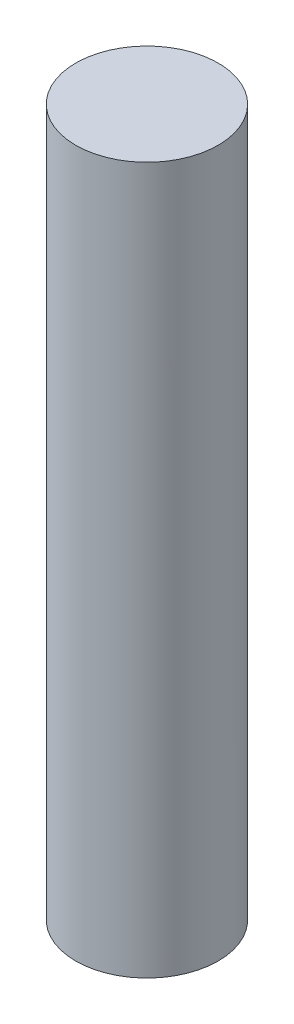
ISO-10303-21;
HEADER;
FILE_DESCRIPTION(('STEP AP214'),'2;1');
FILE_NAME('part.step','',(''),(''),'','','');
FILE_SCHEMA(('AUTOMOTIVE_DESIGN { 1 0 10303 214 1 1 1 1 }'));
ENDSEC;
DATA;
#1=APPLICATION_CONTEXT('core data for automotive mechanical design processes');
#2=APPLICATION_PROTOCOL_DEFINITION('international standard','automotive_design',2000,#1);
#3=PRODUCT_CONTEXT('',#1,'mechanical');
#4=PRODUCT('Part','Part','',(#3));
#5=PRODUCT_RELATED_PRODUCT_CATEGORY('part','',(#4));
#6=PRODUCT_DEFINITION_FORMATION('','',#4);
#7=PRODUCT_DEFINITION_CONTEXT('part definition',#1,'design');
#8=PRODUCT_DEFINITION('design','',#6,#7);
#9=PRODUCT_DEFINITION_SHAPE('','',#8);
#10=(LENGTH_UNIT() NAMED_UNIT(*) SI_UNIT(.MILLI.,.METRE.));
#11=(NAMED_UNIT(*) PLANE_ANGLE_UNIT() SI_UNIT($,.RADIAN.));
#12=(NAMED_UNIT(*) SI_UNIT($,.STERADIAN.) SOLID_ANGLE_UNIT());
#13=UNCERTAINTY_MEASURE_WITH_UNIT(LENGTH_MEASURE(1.E-05),#10,'distance_accuracy_value','');
#14=(GEOMETRIC_REPRESENTATION_CONTEXT(3) GLOBAL_UNCERTAINTY_ASSIGNED_CONTEXT((#13)) GLOBAL_UNIT_ASSIGNED_CONTEXT((#10,
#11,#12)) REPRESENTATION_CONTEXT('',''));
#15=CARTESIAN_POINT('',(0.,0.,0.));
#16=DIRECTION('',(0.,0.,1.));
#17=DIRECTION('',(1.,0.,0.));
#18=AXIS2_PLACEMENT_3D('',#15,#16,#17);
#19=CARTESIAN_POINT('',(3.126,-41.,3.12599999999999));
#20=DIRECTION('',(0.,-1.,0.));
#21=DIRECTION('',(-1.,0.,0.));
#22=AXIS2_PLACEMENT_3D('',#19,#20,#21);
#23=PLANE('',#22);
#24=CARTESIAN_POINT('',(0.,-41.,0.));
#25=DIRECTION('',(0.,-1.,0.));
#26=DIRECTION('',(0.,0.,-1.));
#27=AXIS2_PLACEMENT_3D('',#24,#25,#26);
#28=CIRCLE('',#27,3.125);
#29=CARTESIAN_POINT('',(0.,-41.,-3.12500000000001));
#30=VERTEX_POINT('',#29);
#31=EDGE_CURVE('E22',#30,#30,#28,.F.);
#32=ORIENTED_EDGE('',*,*,#31,.F.);
#33=EDGE_LOOP('',(#32));
#34=FACE_BOUND('',#33,.T.);
#35=ADVANCED_FACE('F15',(#34),#23,.T.);
#36=CARTESIAN_POINT('',(-3.126,-10.,3.126));
#37=DIRECTION('',(0.,1.,0.));
#38=DIRECTION('',(1.,0.,0.));
#39=AXIS2_PLACEMENT_3D('',#36,#37,#38);
#40=PLANE('',#39);
#41=CARTESIAN_POINT('',(0.,-10.,0.));
#42=DIRECTION('',(0.,1.,0.));
#43=DIRECTION('',(0.,0.,1.));
#44=AXIS2_PLACEMENT_3D('',#41,#42,#43);
#45=CIRCLE('',#44,3.125);
#46=CARTESIAN_POINT('',(0.,-10.,3.12499999999999));
#47=VERTEX_POINT('',#46);
#48=EDGE_CURVE('E10',#47,#47,#45,.F.);
#49=ORIENTED_EDGE('',*,*,#48,.F.);
#50=EDGE_LOOP('',(#49));
#51=FACE_BOUND('',#50,.T.);
#52=ADVANCED_FACE('F30',(#51),#40,.T.);
#53=CARTESIAN_POINT('',(0.,-41.,0.));
#54=DIRECTION('',(0.,1.,0.));
#55=DIRECTION('',(0.,0.,1.));
#56=AXIS2_PLACEMENT_3D('',#53,#54,#55);
#57=CYLINDRICAL_SURFACE('',#56,3.125);
#58=ORIENTED_EDGE('',*,*,#48,.T.);
#59=EDGE_LOOP('',(#58));
#60=FACE_BOUND('',#59,.T.);
#61=ORIENTED_EDGE('',*,*,#31,.T.);
#62=EDGE_LOOP('',(#61));
#63=FACE_BOUND('',#62,.T.);
#64=ADVANCED_FACE('F17',(#60,#63),#57,.T.);
#65=CLOSED_SHELL('',(#35,#52,#64));
#66=MANIFOLD_SOLID_BREP('B1',#65);
#67=ADVANCED_BREP_SHAPE_REPRESENTATION('',(#18,#66),#14);
#68=SHAPE_DEFINITION_REPRESENTATION(#9,#67);
ENDSEC;
END-ISO-10303-21;
